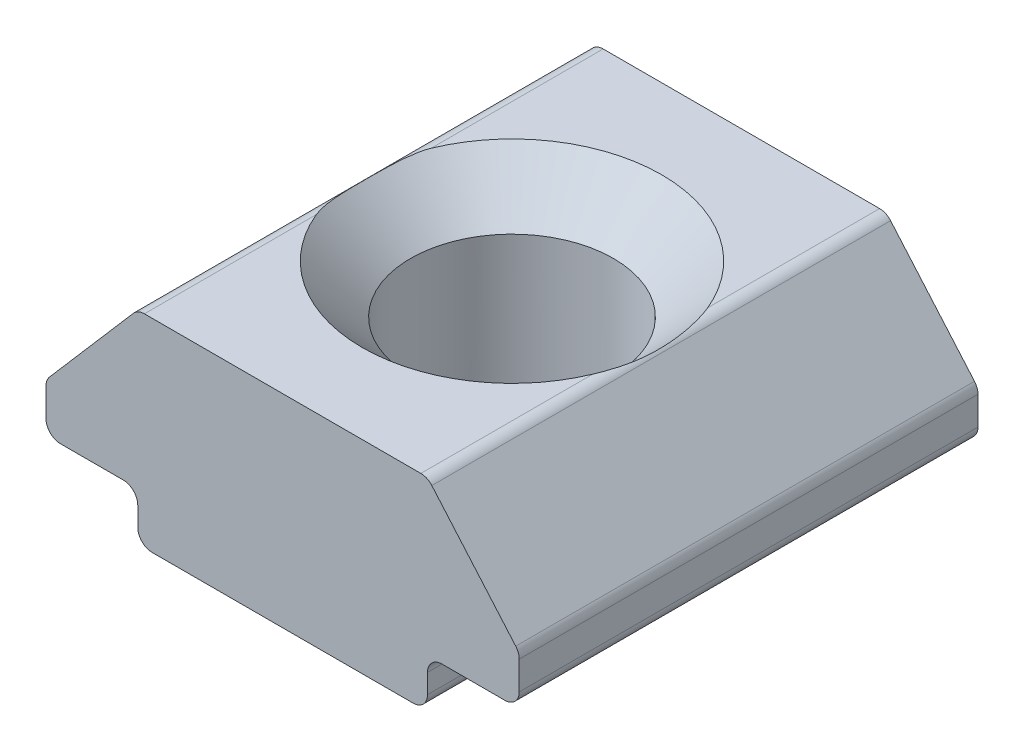
ISO-10303-21;
HEADER;
FILE_DESCRIPTION(('STEP AP214'),'2;1');
FILE_NAME('part.step','',(''),(''),'','','');
FILE_SCHEMA(('AUTOMOTIVE_DESIGN { 1 0 10303 214 1 1 1 1 }'));
ENDSEC;
DATA;
#1=APPLICATION_CONTEXT('core data for automotive mechanical design processes');
#2=APPLICATION_PROTOCOL_DEFINITION('international standard','automotive_design',2000,#1);
#3=PRODUCT_CONTEXT('',#1,'mechanical');
#4=PRODUCT('Part','Part','',(#3));
#5=PRODUCT_RELATED_PRODUCT_CATEGORY('part','',(#4));
#6=PRODUCT_DEFINITION_FORMATION('','',#4);
#7=PRODUCT_DEFINITION_CONTEXT('part definition',#1,'design');
#8=PRODUCT_DEFINITION('design','',#6,#7);
#9=PRODUCT_DEFINITION_SHAPE('','',#8);
#10=(LENGTH_UNIT() NAMED_UNIT(*) SI_UNIT(.MILLI.,.METRE.));
#11=(NAMED_UNIT(*) PLANE_ANGLE_UNIT() SI_UNIT($,.RADIAN.));
#12=(NAMED_UNIT(*) SI_UNIT($,.STERADIAN.) SOLID_ANGLE_UNIT());
#13=UNCERTAINTY_MEASURE_WITH_UNIT(LENGTH_MEASURE(1.E-05),#10,'distance_accuracy_value','');
#14=(GEOMETRIC_REPRESENTATION_CONTEXT(3) GLOBAL_UNCERTAINTY_ASSIGNED_CONTEXT((#13)) GLOBAL_UNIT_ASSIGNED_CONTEXT((#10,
#11,#12)) REPRESENTATION_CONTEXT('',''));
#15=CARTESIAN_POINT('',(0.,0.,0.));
#16=DIRECTION('',(0.,0.,1.));
#17=DIRECTION('',(1.,0.,0.));
#18=AXIS2_PLACEMENT_3D('',#15,#16,#17);
#19=CARTESIAN_POINT('',(1.95069575728712,4.37470932668439,3.52496458987025));
#20=DIRECTION('',(0.,-1.,0.));
#21=DIRECTION('',(0.,0.,-1.));
#22=AXIS2_PLACEMENT_3D('',#19,#20,#21);
#23=PLANE('',#22);
#24=DIRECTION('',(0.,0.,-1.));
#25=VECTOR('',#24,1.);
#26=CARTESIAN_POINT('',(1.81339279763943,4.37470932668439,3.52496458987025));
#27=LINE('',#26,#25);
#28=CARTESIAN_POINT('',(1.81339279763943,4.37470932668439,3.52496458987025));
#29=VERTEX_POINT('',#28);
#30=CARTESIAN_POINT('',(1.81339279763943,4.37470932668439,-0.0355121210941101));
#31=VERTEX_POINT('',#30);
#32=EDGE_CURVE('E234',#29,#31,#27,.T.);
#33=ORIENTED_EDGE('',*,*,#32,.T.);
#34=CARTESIAN_POINT('',(-1.04930424271288,4.37470932668439,-1.22503541012975));
#35=DIRECTION('',(0.,-1.,0.));
#36=DIRECTION('',(0.,0.,-1.));
#37=AXIS2_PLACEMENT_3D('',#34,#35,#36);
#38=CIRCLE('',#37,3.10000000000001);
#39=CARTESIAN_POINT('',(-3.91200128306519,4.37470932668439,-0.0355121210941145));
#40=VERTEX_POINT('',#39);
#41=EDGE_CURVE('E291',#31,#40,#38,.T.);
#42=ORIENTED_EDGE('',*,*,#41,.T.);
#43=DIRECTION('',(0.,0.,-1.));
#44=VECTOR('',#43,1.);
#45=CARTESIAN_POINT('',(-3.91200128306519,4.37470932668439,3.52496458987025));
#46=LINE('',#45,#44);
#47=CARTESIAN_POINT('',(-3.91200128306519,4.37470932668439,3.52496458987025));
#48=VERTEX_POINT('',#47);
#49=EDGE_CURVE('E236',#40,#48,#46,.F.);
#50=ORIENTED_EDGE('',*,*,#49,.T.);
#51=DIRECTION('',(-1.,0.,0.));
#52=VECTOR('',#51,1.);
#53=CARTESIAN_POINT('',(1.95069575728712,4.37470932668439,3.52496458987025));
#54=LINE('',#53,#52);
#55=EDGE_CURVE('E424',#29,#48,#54,.T.);
#56=ORIENTED_EDGE('',*,*,#55,.F.);
#57=EDGE_LOOP('',(#33,#42,#50,#56));
#58=FACE_BOUND('',#57,.T.);
#59=ADVANCED_FACE('F16',(#58),#23,.F.);
#60=CARTESIAN_POINT('',(-4.04930424271288,1.17470932668439,3.52496458987025));
#61=DIRECTION('',(1.,0.,0.));
#62=DIRECTION('',(0.,0.,-1.));
#63=AXIS2_PLACEMENT_3D('',#60,#61,#62);
#64=PLANE('',#63);
#65=DIRECTION('',(0.,-1.,0.));
#66=VECTOR('',#65,1.);
#67=CARTESIAN_POINT('',(-4.04930424271288,1.17470932668439,-5.97503541012975));
#68=LINE('',#67,#66);
#69=CARTESIAN_POINT('',(-4.04930424271288,0.874709326684388,-5.97503541012975));
#70=VERTEX_POINT('',#69);
#71=CARTESIAN_POINT('',(-4.04930424271288,0.474709326684388,-5.97503541012975));
#72=VERTEX_POINT('',#71);
#73=EDGE_CURVE('E428',#70,#72,#68,.T.);
#74=ORIENTED_EDGE('',*,*,#73,.T.);
#75=DIRECTION('',(0.,0.,-1.));
#76=VECTOR('',#75,1.);
#77=CARTESIAN_POINT('',(-4.04930424271288,0.474709326684388,3.52496458987025));
#78=LINE('',#77,#76);
#79=CARTESIAN_POINT('',(-4.04930424271288,0.474709326684388,3.52496458987025));
#80=VERTEX_POINT('',#79);
#81=EDGE_CURVE('E273',#72,#80,#78,.F.);
#82=ORIENTED_EDGE('',*,*,#81,.T.);
#83=DIRECTION('',(0.,-1.,0.));
#84=VECTOR('',#83,1.);
#85=CARTESIAN_POINT('',(-4.04930424271288,1.17470932668439,3.52496458987025));
#86=LINE('',#85,#84);
#87=CARTESIAN_POINT('',(-4.04930424271288,0.874709326684388,3.52496458987025));
#88=VERTEX_POINT('',#87);
#89=EDGE_CURVE('E194',#88,#80,#86,.T.);
#90=ORIENTED_EDGE('',*,*,#89,.F.);
#91=DIRECTION('',(0.,0.,-1.));
#92=VECTOR('',#91,1.);
#93=CARTESIAN_POINT('',(-4.04930424271288,0.874709326684388,-5.97503541012975));
#94=LINE('',#93,#92);
#95=EDGE_CURVE('E270',#88,#70,#94,.T.);
#96=ORIENTED_EDGE('',*,*,#95,.T.);
#97=EDGE_LOOP('',(#74,#82,#90,#96));
#98=FACE_BOUND('',#97,.T.);
#99=ADVANCED_FACE('F349',(#98),#64,.F.);
#100=CARTESIAN_POINT('',(-4.04930424271288,0.174709326684388,3.52496458987025));
#101=DIRECTION('',(0.,1.,0.));
#102=DIRECTION('',(0.,0.,1.));
#103=AXIS2_PLACEMENT_3D('',#100,#101,#102);
#104=PLANE('',#103);
#105=CARTESIAN_POINT('',(-1.04930424271288,0.174709326684388,-1.22503541012975));
#106=DIRECTION('',(0.,1.,0.));
#107=DIRECTION('',(0.,0.,1.));
#108=AXIS2_PLACEMENT_3D('',#105,#106,#107);
#109=CIRCLE('',#108,2.6);
#110=CARTESIAN_POINT('',(-1.04930424271288,0.174709326684388,1.37496458987025));
#111=VERTEX_POINT('',#110);
#112=EDGE_CURVE('E24',#111,#111,#109,.T.);
#113=ORIENTED_EDGE('',*,*,#112,.T.);
#114=EDGE_LOOP('',(#113));
#115=FACE_BOUND('',#114,.T.);
#116=DIRECTION('',(1.,0.,0.));
#117=VECTOR('',#116,1.);
#118=CARTESIAN_POINT('',(-4.04930424271288,0.174709326684388,-5.97503541012975));
#119=LINE('',#118,#117);
#120=CARTESIAN_POINT('',(-3.74930424271288,0.174709326684388,-5.97503541012975));
#121=VERTEX_POINT('',#120);
#122=CARTESIAN_POINT('',(1.65069575728712,0.174709326684388,-5.97503541012975));
#123=VERTEX_POINT('',#122);
#124=EDGE_CURVE('E431',#121,#123,#119,.T.);
#125=ORIENTED_EDGE('',*,*,#124,.T.);
#126=DIRECTION('',(0.,0.,-1.));
#127=VECTOR('',#126,1.);
#128=CARTESIAN_POINT('',(1.65069575728712,0.174709326684388,3.52496458987025));
#129=LINE('',#128,#127);
#130=CARTESIAN_POINT('',(1.65069575728712,0.174709326684388,3.52496458987025));
#131=VERTEX_POINT('',#130);
#132=EDGE_CURVE('E264',#123,#131,#129,.F.);
#133=ORIENTED_EDGE('',*,*,#132,.T.);
#134=DIRECTION('',(1.,0.,0.));
#135=VECTOR('',#134,1.);
#136=CARTESIAN_POINT('',(-4.04930424271288,0.174709326684388,3.52496458987025));
#137=LINE('',#136,#135);
#138=CARTESIAN_POINT('',(-3.74930424271288,0.174709326684388,3.52496458987025));
#139=VERTEX_POINT('',#138);
#140=EDGE_CURVE('E198',#139,#131,#137,.T.);
#141=ORIENTED_EDGE('',*,*,#140,.F.);
#142=DIRECTION('',(0.,0.,-1.));
#143=VECTOR('',#142,1.);
#144=CARTESIAN_POINT('',(-3.74930424271288,0.174709326684388,3.52496458987025));
#145=LINE('',#144,#143);
#146=EDGE_CURVE('E261',#139,#121,#145,.T.);
#147=ORIENTED_EDGE('',*,*,#146,.T.);
#148=EDGE_LOOP('',(#125,#133,#141,#147));
#149=FACE_BOUND('',#148,.T.);
#150=ADVANCED_FACE('F356',(#115,#149),#104,.F.);
#151=CARTESIAN_POINT('',(1.95069575728712,0.174709326684388,3.52496458987025));
#152=DIRECTION('',(-1.,0.,0.));
#153=DIRECTION('',(0.,0.,1.));
#154=AXIS2_PLACEMENT_3D('',#151,#152,#153);
#155=PLANE('',#154);
#156=DIRECTION('',(0.,1.,0.));
#157=VECTOR('',#156,1.);
#158=CARTESIAN_POINT('',(1.95069575728712,0.174709326684388,3.52496458987025));
#159=LINE('',#158,#157);
#160=CARTESIAN_POINT('',(1.95069575728712,0.474709326684388,3.52496458987025));
#161=VERTEX_POINT('',#160);
#162=CARTESIAN_POINT('',(1.95069575728712,0.874709326684388,3.52496458987025));
#163=VERTEX_POINT('',#162);
#164=EDGE_CURVE('E464',#161,#163,#159,.T.);
#165=ORIENTED_EDGE('',*,*,#164,.F.);
#166=DIRECTION('',(0.,0.,-1.));
#167=VECTOR('',#166,1.);
#168=CARTESIAN_POINT('',(1.95069575728712,0.474709326684388,3.52496458987025));
#169=LINE('',#168,#167);
#170=CARTESIAN_POINT('',(1.95069575728712,0.474709326684388,-5.97503541012975));
#171=VERTEX_POINT('',#170);
#172=EDGE_CURVE('E254',#161,#171,#169,.T.);
#173=ORIENTED_EDGE('',*,*,#172,.T.);
#174=DIRECTION('',(0.,1.,0.));
#175=VECTOR('',#174,1.);
#176=CARTESIAN_POINT('',(1.95069575728712,0.174709326684388,-5.97503541012975));
#177=LINE('',#176,#175);
#178=CARTESIAN_POINT('',(1.95069575728712,0.874709326684388,-5.97503541012975));
#179=VERTEX_POINT('',#178);
#180=EDGE_CURVE('E434',#171,#179,#177,.T.);
#181=ORIENTED_EDGE('',*,*,#180,.T.);
#182=DIRECTION('',(0.,0.,-1.));
#183=VECTOR('',#182,1.);
#184=CARTESIAN_POINT('',(1.95069575728712,0.874709326684388,3.52496458987025));
#185=LINE('',#184,#183);
#186=EDGE_CURVE('E252',#179,#163,#185,.F.);
#187=ORIENTED_EDGE('',*,*,#186,.T.);
#188=EDGE_LOOP('',(#165,#173,#181,#187));
#189=FACE_BOUND('',#188,.T.);
#190=ADVANCED_FACE('F475',(#189),#155,.F.);
#191=CARTESIAN_POINT('',(1.95069575728712,1.17470932668439,3.52496458987025));
#192=DIRECTION('',(0.,1.,0.));
#193=DIRECTION('',(0.,0.,1.));
#194=AXIS2_PLACEMENT_3D('',#191,#192,#193);
#195=PLANE('',#194);
#196=DIRECTION('',(1.,0.,0.));
#197=VECTOR('',#196,1.);
#198=CARTESIAN_POINT('',(1.95069575728712,1.17470932668439,3.52496458987025));
#199=LINE('',#198,#197);
#200=CARTESIAN_POINT('',(2.25069575728712,1.17470932668439,3.52496458987025));
#201=VERTEX_POINT('',#200);
#202=CARTESIAN_POINT('',(3.55069575728712,1.17470932668439,3.52496458987025));
#203=VERTEX_POINT('',#202);
#204=EDGE_CURVE('E462',#201,#203,#199,.T.);
#205=ORIENTED_EDGE('',*,*,#204,.F.);
#206=DIRECTION('',(0.,0.,-1.));
#207=VECTOR('',#206,1.);
#208=CARTESIAN_POINT('',(2.25069575728712,1.17470932668439,-5.97503541012975));
#209=LINE('',#208,#207);
#210=CARTESIAN_POINT('',(2.25069575728712,1.17470932668439,-5.97503541012975));
#211=VERTEX_POINT('',#210);
#212=EDGE_CURVE('E275',#201,#211,#209,.T.);
#213=ORIENTED_EDGE('',*,*,#212,.T.);
#214=DIRECTION('',(1.,0.,0.));
#215=VECTOR('',#214,1.);
#216=CARTESIAN_POINT('',(1.95069575728712,1.17470932668439,-5.97503541012975));
#217=LINE('',#216,#215);
#218=CARTESIAN_POINT('',(3.55069575728712,1.17470932668439,-5.97503541012975));
#219=VERTEX_POINT('',#218);
#220=EDGE_CURVE('E437',#211,#219,#217,.T.);
#221=ORIENTED_EDGE('',*,*,#220,.T.);
#222=DIRECTION('',(0.,0.,-1.));
#223=VECTOR('',#222,1.);
#224=CARTESIAN_POINT('',(3.55069575728712,1.17470932668439,3.52496458987025));
#225=LINE('',#224,#223);
#226=EDGE_CURVE('E249',#219,#203,#225,.F.);
#227=ORIENTED_EDGE('',*,*,#226,.T.);
#228=EDGE_LOOP('',(#205,#213,#221,#227));
#229=FACE_BOUND('',#228,.T.);
#230=ADVANCED_FACE('F483',(#229),#195,.F.);
#231=CARTESIAN_POINT('',(3.85069575728712,1.17470932668439,3.52496458987025));
#232=DIRECTION('',(-1.,0.,0.));
#233=DIRECTION('',(0.,0.,1.));
#234=AXIS2_PLACEMENT_3D('',#231,#232,#233);
#235=PLANE('',#234);
#236=DIRECTION('',(0.,1.,0.));
#237=VECTOR('',#236,1.);
#238=CARTESIAN_POINT('',(3.85069575728712,1.17470932668439,-5.97503541012975));
#239=LINE('',#238,#237);
#240=CARTESIAN_POINT('',(3.85069575728712,1.47470932668439,-5.97503541012975));
#241=VERTEX_POINT('',#240);
#242=CARTESIAN_POINT('',(3.85069575728712,2.06309537340811,-5.97503541012975));
#243=VERTEX_POINT('',#242);
#244=EDGE_CURVE('E439',#241,#243,#239,.T.);
#245=ORIENTED_EDGE('',*,*,#244,.T.);
#246=DIRECTION('',(0.,0.,-1.));
#247=VECTOR('',#246,1.);
#248=CARTESIAN_POINT('',(3.85069575728712,2.06309537340811,3.52496458987025));
#249=LINE('',#248,#247);
#250=CARTESIAN_POINT('',(3.85069575728712,2.06309537340811,3.52496458987025));
#251=VERTEX_POINT('',#250);
#252=EDGE_CURVE('E247',#243,#251,#249,.F.);
#253=ORIENTED_EDGE('',*,*,#252,.T.);
#254=DIRECTION('',(0.,1.,0.));
#255=VECTOR('',#254,1.);
#256=CARTESIAN_POINT('',(3.85069575728712,1.17470932668439,3.52496458987025));
#257=LINE('',#256,#255);
#258=CARTESIAN_POINT('',(3.85069575728712,1.47470932668439,3.52496458987025));
#259=VERTEX_POINT('',#258);
#260=EDGE_CURVE('E457',#259,#251,#257,.T.);
#261=ORIENTED_EDGE('',*,*,#260,.F.);
#262=DIRECTION('',(0.,0.,-1.));
#263=VECTOR('',#262,1.);
#264=CARTESIAN_POINT('',(3.85069575728712,1.47470932668439,3.52496458987025));
#265=LINE('',#264,#263);
#266=EDGE_CURVE('E244',#259,#241,#265,.T.);
#267=ORIENTED_EDGE('',*,*,#266,.T.);
#268=EDGE_LOOP('',(#245,#253,#261,#267));
#269=FACE_BOUND('',#268,.T.);
#270=ADVANCED_FACE('F370',(#269),#235,.F.);
#271=CARTESIAN_POINT('',(3.85069575728712,2.17470932668439,3.52496458987025));
#272=DIRECTION('',(-0.756823007769159,-0.653619870346093,0.));
#273=DIRECTION('',(0.653619870346093,-0.756823007769159,0.));
#274=AXIS2_PLACEMENT_3D('',#271,#272,#273);
#275=PLANE('',#274);
#276=DIRECTION('',(-0.653619870346093,0.756823007769159,0.));
#277=VECTOR('',#276,1.);
#278=CARTESIAN_POINT('',(3.85069575728712,2.17470932668439,-5.97503541012975));
#279=LINE('',#278,#277);
#280=CARTESIAN_POINT('',(3.77774265961787,2.25918133451194,-5.97503541012975));
#281=VERTEX_POINT('',#280);
#282=CARTESIAN_POINT('',(2.04043969997018,4.27079528778822,-5.97503541012975));
#283=VERTEX_POINT('',#282);
#284=EDGE_CURVE('E442',#281,#283,#279,.T.);
#285=ORIENTED_EDGE('',*,*,#284,.T.);
#286=DIRECTION('',(0.,0.,-1.));
#287=VECTOR('',#286,1.);
#288=CARTESIAN_POINT('',(2.04043969997018,4.27079528778822,3.52496458987025));
#289=LINE('',#288,#287);
#290=CARTESIAN_POINT('',(2.04043969997018,4.27079528778822,3.52496458987025));
#291=VERTEX_POINT('',#290);
#292=EDGE_CURVE('E242',#283,#291,#289,.F.);
#293=ORIENTED_EDGE('',*,*,#292,.T.);
#294=DIRECTION('',(-0.653619870346093,0.756823007769159,0.));
#295=VECTOR('',#294,1.);
#296=CARTESIAN_POINT('',(3.85069575728712,2.17470932668439,3.52496458987025));
#297=LINE('',#296,#295);
#298=CARTESIAN_POINT('',(3.77774265961787,2.25918133451194,3.52496458987025));
#299=VERTEX_POINT('',#298);
#300=EDGE_CURVE('E455',#299,#291,#297,.T.);
#301=ORIENTED_EDGE('',*,*,#300,.F.);
#302=DIRECTION('',(0.,0.,-1.));
#303=VECTOR('',#302,1.);
#304=CARTESIAN_POINT('',(3.77774265961787,2.25918133451194,3.52496458987025));
#305=LINE('',#304,#303);
#306=EDGE_CURVE('E239',#299,#281,#305,.T.);
#307=ORIENTED_EDGE('',*,*,#306,.T.);
#308=EDGE_LOOP('',(#285,#293,#301,#307));
#309=FACE_BOUND('',#308,.T.);
#310=ADVANCED_FACE('F363',(#309),#275,.F.);
#311=CARTESIAN_POINT('',(-3.91200128306519,4.37470932668439,-5.97503541012975));
#312=VERTEX_POINT('',#311);
#313=CARTESIAN_POINT('',(-3.91200128306519,4.37470932668439,-2.41455869916539));
#314=VERTEX_POINT('',#313);
#315=EDGE_CURVE('E237',#312,#314,#46,.F.);
#316=ORIENTED_EDGE('',*,*,#315,.T.);
#317=CARTESIAN_POINT('',(-1.04930424271288,4.37470932668439,-1.22503541012975));
#318=DIRECTION('',(0.,-1.,0.));
#319=DIRECTION('',(0.,0.,-1.));
#320=AXIS2_PLACEMENT_3D('',#317,#318,#319);
#321=CIRCLE('',#320,3.10000000000001);
#322=CARTESIAN_POINT('',(1.81339279763943,4.37470932668439,-2.41455869916539));
#323=VERTEX_POINT('',#322);
#324=EDGE_CURVE('E31',#314,#323,#321,.T.);
#325=ORIENTED_EDGE('',*,*,#324,.T.);
#326=CARTESIAN_POINT('',(1.81339279763943,4.37470932668439,-5.97503541012975));
#327=VERTEX_POINT('',#326);
#328=EDGE_CURVE('E233',#323,#327,#27,.T.);
#329=ORIENTED_EDGE('',*,*,#328,.T.);
#330=DIRECTION('',(-1.,0.,0.));
#331=VECTOR('',#330,1.);
#332=CARTESIAN_POINT('',(1.95069575728712,4.37470932668439,-5.97503541012975));
#333=LINE('',#332,#331);
#334=EDGE_CURVE('E375',#327,#312,#333,.T.);
#335=ORIENTED_EDGE('',*,*,#334,.T.);
#336=EDGE_LOOP('',(#316,#325,#329,#335));
#337=FACE_BOUND('',#336,.T.);
#338=ADVANCED_FACE('F352',(#337),#23,.F.);
#339=CARTESIAN_POINT('',(-5.94930424271288,2.17470932668439,3.52496458987025));
#340=DIRECTION('',(0.756823007769159,-0.653619870346093,0.));
#341=DIRECTION('',(0.653619870346093,0.756823007769159,0.));
#342=AXIS2_PLACEMENT_3D('',#339,#340,#341);
#343=PLANE('',#342);
#344=DIRECTION('',(-0.653619870346093,-0.756823007769159,0.));
#345=VECTOR('',#344,1.);
#346=CARTESIAN_POINT('',(-5.94930424271288,2.17470932668439,-5.97503541012975));
#347=LINE('',#346,#345);
#348=CARTESIAN_POINT('',(-4.13904818539594,4.27079528778822,-5.97503541012975));
#349=VERTEX_POINT('',#348);
#350=CARTESIAN_POINT('',(-5.87635114504363,2.25918133451194,-5.97503541012975));
#351=VERTEX_POINT('',#350);
#352=EDGE_CURVE('E200',#349,#351,#347,.T.);
#353=ORIENTED_EDGE('',*,*,#352,.T.);
#354=DIRECTION('',(0.,0.,-1.));
#355=VECTOR('',#354,1.);
#356=CARTESIAN_POINT('',(-5.87635114504363,2.25918133451194,3.52496458987025));
#357=LINE('',#356,#355);
#358=CARTESIAN_POINT('',(-5.87635114504363,2.25918133451194,3.52496458987025));
#359=VERTEX_POINT('',#358);
#360=EDGE_CURVE('E231',#351,#359,#357,.F.);
#361=ORIENTED_EDGE('',*,*,#360,.T.);
#362=DIRECTION('',(-0.653619870346093,-0.756823007769159,0.));
#363=VECTOR('',#362,1.);
#364=CARTESIAN_POINT('',(-5.94930424271288,2.17470932668439,3.52496458987025));
#365=LINE('',#364,#363);
#366=CARTESIAN_POINT('',(-4.13904818539594,4.27079528778822,3.52496458987025));
#367=VERTEX_POINT('',#366);
#368=EDGE_CURVE('E421',#367,#359,#365,.T.);
#369=ORIENTED_EDGE('',*,*,#368,.F.);
#370=DIRECTION('',(0.,0.,-1.));
#371=VECTOR('',#370,1.);
#372=CARTESIAN_POINT('',(-4.13904818539594,4.27079528778822,3.52496458987025));
#373=LINE('',#372,#371);
#374=EDGE_CURVE('E228',#367,#349,#373,.T.);
#375=ORIENTED_EDGE('',*,*,#374,.T.);
#376=EDGE_LOOP('',(#353,#361,#369,#375));
#377=FACE_BOUND('',#376,.T.);
#378=ADVANCED_FACE('F362',(#377),#343,.F.);
#379=CARTESIAN_POINT('',(-5.94930424271288,1.17470932668439,3.52496458987025));
#380=DIRECTION('',(1.,0.,0.));
#381=DIRECTION('',(0.,0.,-1.));
#382=AXIS2_PLACEMENT_3D('',#379,#380,#381);
#383=PLANE('',#382);
#384=DIRECTION('',(0.,-1.,0.));
#385=VECTOR('',#384,1.);
#386=CARTESIAN_POINT('',(-5.94930424271288,1.17470932668439,-5.97503541012975));
#387=LINE('',#386,#385);
#388=CARTESIAN_POINT('',(-5.94930424271288,2.06309537340811,-5.97503541012975));
#389=VERTEX_POINT('',#388);
#390=CARTESIAN_POINT('',(-5.94930424271288,1.47470932668439,-5.97503541012975));
#391=VERTEX_POINT('',#390);
#392=EDGE_CURVE('E195',#389,#391,#387,.T.);
#393=ORIENTED_EDGE('',*,*,#392,.T.);
#394=DIRECTION('',(0.,0.,-1.));
#395=VECTOR('',#394,1.);
#396=CARTESIAN_POINT('',(-5.94930424271288,1.47470932668439,3.52496458987025));
#397=LINE('',#396,#395);
#398=CARTESIAN_POINT('',(-5.94930424271288,1.47470932668439,3.52496458987025));
#399=VERTEX_POINT('',#398);
#400=EDGE_CURVE('E172',#391,#399,#397,.F.);
#401=ORIENTED_EDGE('',*,*,#400,.T.);
#402=DIRECTION('',(0.,-1.,0.));
#403=VECTOR('',#402,1.);
#404=CARTESIAN_POINT('',(-5.94930424271288,1.17470932668439,3.52496458987025));
#405=LINE('',#404,#403);
#406=CARTESIAN_POINT('',(-5.94930424271288,2.06309537340811,3.52496458987025));
#407=VERTEX_POINT('',#406);
#408=EDGE_CURVE('E420',#407,#399,#405,.T.);
#409=ORIENTED_EDGE('',*,*,#408,.F.);
#410=DIRECTION('',(0.,0.,-1.));
#411=VECTOR('',#410,1.);
#412=CARTESIAN_POINT('',(-5.94930424271288,2.06309537340811,3.52496458987025));
#413=LINE('',#412,#411);
#414=EDGE_CURVE('E177',#407,#389,#413,.T.);
#415=ORIENTED_EDGE('',*,*,#414,.T.);
#416=EDGE_LOOP('',(#393,#401,#409,#415));
#417=FACE_BOUND('',#416,.T.);
#418=ADVANCED_FACE('F368',(#417),#383,.F.);
#419=CARTESIAN_POINT('',(-5.94930424271288,1.17470932668439,3.52496458987025));
#420=DIRECTION('',(0.,1.,0.));
#421=DIRECTION('',(0.,0.,1.));
#422=AXIS2_PLACEMENT_3D('',#419,#420,#421);
#423=PLANE('',#422);
#424=DIRECTION('',(1.,0.,0.));
#425=VECTOR('',#424,1.);
#426=CARTESIAN_POINT('',(-5.94930424271288,1.17470932668439,-5.97503541012975));
#427=LINE('',#426,#425);
#428=CARTESIAN_POINT('',(-5.64930424271288,1.17470932668439,-5.97503541012975));
#429=VERTEX_POINT('',#428);
#430=CARTESIAN_POINT('',(-4.34930424271288,1.17470932668439,-5.97503541012975));
#431=VERTEX_POINT('',#430);
#432=EDGE_CURVE('E184',#429,#431,#427,.T.);
#433=ORIENTED_EDGE('',*,*,#432,.T.);
#434=DIRECTION('',(0.,0.,-1.));
#435=VECTOR('',#434,1.);
#436=CARTESIAN_POINT('',(-4.34930424271288,1.17470932668439,3.52496458987025));
#437=LINE('',#436,#435);
#438=CARTESIAN_POINT('',(-4.34930424271288,1.17470932668439,3.52496458987025));
#439=VERTEX_POINT('',#438);
#440=EDGE_CURVE('E278',#431,#439,#437,.F.);
#441=ORIENTED_EDGE('',*,*,#440,.T.);
#442=DIRECTION('',(1.,0.,0.));
#443=VECTOR('',#442,1.);
#444=CARTESIAN_POINT('',(-5.94930424271288,1.17470932668439,3.52496458987025));
#445=LINE('',#444,#443);
#446=CARTESIAN_POINT('',(-5.64930424271288,1.17470932668439,3.52496458987025));
#447=VERTEX_POINT('',#446);
#448=EDGE_CURVE('E187',#447,#439,#445,.T.);
#449=ORIENTED_EDGE('',*,*,#448,.F.);
#450=DIRECTION('',(0.,0.,-1.));
#451=VECTOR('',#450,1.);
#452=CARTESIAN_POINT('',(-5.64930424271288,1.17470932668439,3.52496458987025));
#453=LINE('',#452,#451);
#454=EDGE_CURVE('E171',#447,#429,#453,.T.);
#455=ORIENTED_EDGE('',*,*,#454,.T.);
#456=EDGE_LOOP('',(#433,#441,#449,#455));
#457=FACE_BOUND('',#456,.T.);
#458=ADVANCED_FACE('F183',(#457),#423,.F.);
#459=CARTESIAN_POINT('',(-1.04930424271288,0.174709326684388,3.52496458987025));
#460=DIRECTION('',(0.,0.,1.));
#461=DIRECTION('',(1.,0.,0.));
#462=AXIS2_PLACEMENT_3D('',#459,#460,#461);
#463=PLANE('',#462);
#464=ORIENTED_EDGE('',*,*,#140,.T.);
#465=CARTESIAN_POINT('',(1.65069575728712,0.474709326684388,3.52496458987025));
#466=DIRECTION('',(0.,0.,1.));
#467=DIRECTION('',(1.,0.,0.));
#468=AXIS2_PLACEMENT_3D('',#465,#466,#467);
#469=CIRCLE('',#468,0.3);
#470=EDGE_CURVE('E268',#131,#161,#469,.T.);
#471=ORIENTED_EDGE('',*,*,#470,.T.);
#472=ORIENTED_EDGE('',*,*,#164,.T.);
#473=CARTESIAN_POINT('',(2.25069575728712,0.874709326684388,3.52496458987025));
#474=DIRECTION('',(0.,0.,1.));
#475=DIRECTION('',(1.,0.,0.));
#476=AXIS2_PLACEMENT_3D('',#473,#474,#475);
#477=CIRCLE('',#476,0.3);
#478=EDGE_CURVE('E282',#163,#201,#477,.F.);
#479=ORIENTED_EDGE('',*,*,#478,.T.);
#480=ORIENTED_EDGE('',*,*,#204,.T.);
#481=CARTESIAN_POINT('',(3.55069575728712,1.47470932668439,3.52496458987025));
#482=DIRECTION('',(0.,0.,1.));
#483=DIRECTION('',(1.,0.,0.));
#484=AXIS2_PLACEMENT_3D('',#481,#482,#483);
#485=CIRCLE('',#484,0.3);
#486=EDGE_CURVE('E216',#203,#259,#485,.T.);
#487=ORIENTED_EDGE('',*,*,#486,.T.);
#488=ORIENTED_EDGE('',*,*,#260,.T.);
#489=CARTESIAN_POINT('',(3.55069575728712,2.06309537340811,3.52496458987025));
#490=DIRECTION('',(0.,0.,1.));
#491=DIRECTION('',(1.,0.,0.));
#492=AXIS2_PLACEMENT_3D('',#489,#490,#491);
#493=CIRCLE('',#492,0.3);
#494=EDGE_CURVE('E218',#251,#299,#493,.T.);
#495=ORIENTED_EDGE('',*,*,#494,.T.);
#496=ORIENTED_EDGE('',*,*,#300,.T.);
#497=CARTESIAN_POINT('',(1.81339279763943,4.07470932668439,3.52496458987025));
#498=DIRECTION('',(0.,0.,1.));
#499=DIRECTION('',(1.,0.,0.));
#500=AXIS2_PLACEMENT_3D('',#497,#498,#499);
#501=CIRCLE('',#500,0.3);
#502=EDGE_CURVE('E220',#291,#29,#501,.T.);
#503=ORIENTED_EDGE('',*,*,#502,.T.);
#504=ORIENTED_EDGE('',*,*,#55,.T.);
#505=CARTESIAN_POINT('',(-3.91200128306519,4.07470932668439,3.52496458987025));
#506=DIRECTION('',(0.,0.,1.));
#507=DIRECTION('',(1.,0.,0.));
#508=AXIS2_PLACEMENT_3D('',#505,#506,#507);
#509=CIRCLE('',#508,0.3);
#510=EDGE_CURVE('E222',#48,#367,#509,.T.);
#511=ORIENTED_EDGE('',*,*,#510,.T.);
#512=ORIENTED_EDGE('',*,*,#368,.T.);
#513=CARTESIAN_POINT('',(-5.64930424271288,2.06309537340811,3.52496458987025));
#514=DIRECTION('',(0.,0.,1.));
#515=DIRECTION('',(1.,0.,0.));
#516=AXIS2_PLACEMENT_3D('',#513,#514,#515);
#517=CIRCLE('',#516,0.3);
#518=EDGE_CURVE('E224',#359,#407,#517,.T.);
#519=ORIENTED_EDGE('',*,*,#518,.T.);
#520=ORIENTED_EDGE('',*,*,#408,.T.);
#521=CARTESIAN_POINT('',(-5.64930424271288,1.47470932668439,3.52496458987025));
#522=DIRECTION('',(0.,0.,1.));
#523=DIRECTION('',(1.,0.,0.));
#524=AXIS2_PLACEMENT_3D('',#521,#522,#523);
#525=CIRCLE('',#524,0.3);
#526=EDGE_CURVE('E226',#399,#447,#525,.T.);
#527=ORIENTED_EDGE('',*,*,#526,.T.);
#528=ORIENTED_EDGE('',*,*,#448,.T.);
#529=CARTESIAN_POINT('',(-4.34930424271288,0.874709326684388,3.52496458987025));
#530=DIRECTION('',(0.,0.,1.));
#531=DIRECTION('',(1.,0.,0.));
#532=AXIS2_PLACEMENT_3D('',#529,#530,#531);
#533=CIRCLE('',#532,0.3);
#534=EDGE_CURVE('E285',#439,#88,#533,.F.);
#535=ORIENTED_EDGE('',*,*,#534,.T.);
#536=ORIENTED_EDGE('',*,*,#89,.T.);
#537=CARTESIAN_POINT('',(-3.74930424271288,0.474709326684388,3.52496458987025));
#538=DIRECTION('',(0.,0.,1.));
#539=DIRECTION('',(1.,0.,0.));
#540=AXIS2_PLACEMENT_3D('',#537,#538,#539);
#541=CIRCLE('',#540,0.3);
#542=EDGE_CURVE('E266',#80,#139,#541,.T.);
#543=ORIENTED_EDGE('',*,*,#542,.T.);
#544=EDGE_LOOP('',(#464,#471,#472,#479,#480,#487,#488,#495,#496,#503,#504,#511,#512,#519,#520,
#527,#528,#535,#536,#543));
#545=FACE_BOUND('',#544,.T.);
#546=ADVANCED_FACE('F396',(#545),#463,.T.);
#547=CARTESIAN_POINT('',(-1.04930424271288,0.174709326684388,-5.97503541012975));
#548=DIRECTION('',(0.,0.,1.));
#549=DIRECTION('',(1.,0.,0.));
#550=AXIS2_PLACEMENT_3D('',#547,#548,#549);
#551=PLANE('',#550);
#552=ORIENTED_EDGE('',*,*,#180,.F.);
#553=CARTESIAN_POINT('',(1.65069575728712,0.474709326684388,-5.97503541012975));
#554=DIRECTION('',(0.,0.,1.));
#555=DIRECTION('',(1.,0.,0.));
#556=AXIS2_PLACEMENT_3D('',#553,#554,#555);
#557=CIRCLE('',#556,0.3);
#558=EDGE_CURVE('E259',#171,#123,#557,.F.);
#559=ORIENTED_EDGE('',*,*,#558,.T.);
#560=ORIENTED_EDGE('',*,*,#124,.F.);
#561=CARTESIAN_POINT('',(-3.74930424271288,0.474709326684388,-5.97503541012975));
#562=DIRECTION('',(0.,0.,1.));
#563=DIRECTION('',(1.,0.,0.));
#564=AXIS2_PLACEMENT_3D('',#561,#562,#563);
#565=CIRCLE('',#564,0.3);
#566=EDGE_CURVE('E257',#121,#72,#565,.F.);
#567=ORIENTED_EDGE('',*,*,#566,.T.);
#568=ORIENTED_EDGE('',*,*,#73,.F.);
#569=CARTESIAN_POINT('',(-4.34930424271288,0.874709326684388,-5.97503541012975));
#570=DIRECTION('',(0.,0.,1.));
#571=DIRECTION('',(1.,0.,0.));
#572=AXIS2_PLACEMENT_3D('',#569,#570,#571);
#573=CIRCLE('',#572,0.3);
#574=EDGE_CURVE('E193',#70,#431,#573,.T.);
#575=ORIENTED_EDGE('',*,*,#574,.T.);
#576=ORIENTED_EDGE('',*,*,#432,.F.);
#577=CARTESIAN_POINT('',(-5.64930424271288,1.47470932668439,-5.97503541012975));
#578=DIRECTION('',(0.,0.,1.));
#579=DIRECTION('',(1.,0.,0.));
#580=AXIS2_PLACEMENT_3D('',#577,#578,#579);
#581=CIRCLE('',#580,0.3);
#582=EDGE_CURVE('E167',#429,#391,#581,.F.);
#583=ORIENTED_EDGE('',*,*,#582,.T.);
#584=ORIENTED_EDGE('',*,*,#392,.F.);
#585=CARTESIAN_POINT('',(-5.64930424271288,2.06309537340811,-5.97503541012975));
#586=DIRECTION('',(0.,0.,1.));
#587=DIRECTION('',(1.,0.,0.));
#588=AXIS2_PLACEMENT_3D('',#585,#586,#587);
#589=CIRCLE('',#588,0.3);
#590=EDGE_CURVE('E178',#389,#351,#589,.F.);
#591=ORIENTED_EDGE('',*,*,#590,.T.);
#592=ORIENTED_EDGE('',*,*,#352,.F.);
#593=CARTESIAN_POINT('',(-3.91200128306519,4.07470932668439,-5.97503541012975));
#594=DIRECTION('',(0.,0.,1.));
#595=DIRECTION('',(1.,0.,0.));
#596=AXIS2_PLACEMENT_3D('',#593,#594,#595);
#597=CIRCLE('',#596,0.3);
#598=EDGE_CURVE('E210',#349,#312,#597,.F.);
#599=ORIENTED_EDGE('',*,*,#598,.T.);
#600=ORIENTED_EDGE('',*,*,#334,.F.);
#601=CARTESIAN_POINT('',(1.81339279763943,4.07470932668439,-5.97503541012975));
#602=DIRECTION('',(0.,0.,1.));
#603=DIRECTION('',(1.,0.,0.));
#604=AXIS2_PLACEMENT_3D('',#601,#602,#603);
#605=CIRCLE('',#604,0.3);
#606=EDGE_CURVE('E208',#327,#283,#605,.F.);
#607=ORIENTED_EDGE('',*,*,#606,.T.);
#608=ORIENTED_EDGE('',*,*,#284,.F.);
#609=CARTESIAN_POINT('',(3.55069575728712,2.06309537340811,-5.97503541012975));
#610=DIRECTION('',(0.,0.,1.));
#611=DIRECTION('',(1.,0.,0.));
#612=AXIS2_PLACEMENT_3D('',#609,#610,#611);
#613=CIRCLE('',#612,0.3);
#614=EDGE_CURVE('E206',#281,#243,#613,.F.);
#615=ORIENTED_EDGE('',*,*,#614,.T.);
#616=ORIENTED_EDGE('',*,*,#244,.F.);
#617=CARTESIAN_POINT('',(3.55069575728712,1.47470932668439,-5.97503541012975));
#618=DIRECTION('',(0.,0.,1.));
#619=DIRECTION('',(1.,0.,0.));
#620=AXIS2_PLACEMENT_3D('',#617,#618,#619);
#621=CIRCLE('',#620,0.3);
#622=EDGE_CURVE('E188',#241,#219,#621,.F.);
#623=ORIENTED_EDGE('',*,*,#622,.T.);
#624=ORIENTED_EDGE('',*,*,#220,.F.);
#625=CARTESIAN_POINT('',(2.25069575728712,0.874709326684388,-5.97503541012975));
#626=DIRECTION('',(0.,0.,1.));
#627=DIRECTION('',(1.,0.,0.));
#628=AXIS2_PLACEMENT_3D('',#625,#626,#627);
#629=CIRCLE('',#628,0.3);
#630=EDGE_CURVE('E280',#211,#179,#629,.T.);
#631=ORIENTED_EDGE('',*,*,#630,.T.);
#632=EDGE_LOOP('',(#552,#559,#560,#567,#568,#575,#576,#583,#584,#591,#592,#599,#600,#607,#608,
#615,#616,#623,#624,#631));
#633=FACE_BOUND('',#632,.T.);
#634=ADVANCED_FACE('F191',(#633),#551,.F.);
#635=CARTESIAN_POINT('',(-5.64930424271288,1.47470932668439,3.52496458987025));
#636=DIRECTION('',(0.,0.,-1.));
#637=DIRECTION('',(-1.,0.,0.));
#638=AXIS2_PLACEMENT_3D('',#635,#636,#637);
#639=CYLINDRICAL_SURFACE('',#638,0.3);
#640=ORIENTED_EDGE('',*,*,#526,.F.);
#641=ORIENTED_EDGE('',*,*,#400,.F.);
#642=ORIENTED_EDGE('',*,*,#582,.F.);
#643=ORIENTED_EDGE('',*,*,#454,.F.);
#644=EDGE_LOOP('',(#640,#641,#642,#643));
#645=FACE_BOUND('',#644,.T.);
#646=ADVANCED_FACE('F170',(#645),#639,.T.);
#647=CARTESIAN_POINT('',(-5.64930424271288,2.06309537340811,3.52496458987025));
#648=DIRECTION('',(0.,0.,-1.));
#649=DIRECTION('',(-1.,0.,0.));
#650=AXIS2_PLACEMENT_3D('',#647,#648,#649);
#651=CYLINDRICAL_SURFACE('',#650,0.3);
#652=ORIENTED_EDGE('',*,*,#518,.F.);
#653=ORIENTED_EDGE('',*,*,#360,.F.);
#654=ORIENTED_EDGE('',*,*,#590,.F.);
#655=ORIENTED_EDGE('',*,*,#414,.F.);
#656=EDGE_LOOP('',(#652,#653,#654,#655));
#657=FACE_BOUND('',#656,.T.);
#658=ADVANCED_FACE('F346',(#657),#651,.T.);
#659=CARTESIAN_POINT('',(-3.91200128306519,4.07470932668439,3.52496458987025));
#660=DIRECTION('',(0.,0.,-1.));
#661=DIRECTION('',(-1.,0.,0.));
#662=AXIS2_PLACEMENT_3D('',#659,#660,#661);
#663=CYLINDRICAL_SURFACE('',#662,0.3);
#664=ORIENTED_EDGE('',*,*,#49,.F.);
#665=CARTESIAN_POINT('',(-3.91200128306519,4.37470932668439,-0.0355121210941145));
#666=CARTESIAN_POINT('',(-3.92093273809777,4.374693554572,-0.0570470098650926));
#667=CARTESIAN_POINT('',(-3.9292758887637,4.37431076890047,-0.0788089705163304));
#668=CARTESIAN_POINT('',(-3.94494482720037,4.37300263556177,-0.122661683139957));
#669=CARTESIAN_POINT('',(-3.95227146699118,4.37207774571544,-0.144752142362414));
#670=CARTESIAN_POINT('',(-3.96606257664397,4.36987915694666,-0.189113489681193));
#671=CARTESIAN_POINT('',(-3.97252931070409,4.36860640214351,-0.211383733310665));
#672=CARTESIAN_POINT('',(-3.98473170266188,4.36582694088956,-0.256113691522338));
#673=CARTESIAN_POINT('',(-3.99046718080865,4.36432017711785,-0.278573451248721));
#674=CARTESIAN_POINT('',(-4.00674249906433,4.35958293741409,-0.346311434359917));
#675=CARTESIAN_POINT('',(-4.01630937565047,4.35614362496227,-0.391809495301165));
#676=CARTESIAN_POINT('',(-4.03334820461454,4.34922449801373,-0.483228453602967));
#677=CARTESIAN_POINT('',(-4.04081808712094,4.34574464700585,-0.529149722855095));
#678=CARTESIAN_POINT('',(-4.05562337016144,4.33825858887728,-0.632797498845656));
#679=CARTESIAN_POINT('',(-4.06245712813846,4.33433864557491,-0.690601905347718));
#680=CARTESIAN_POINT('',(-4.07376990477512,4.32744304562369,-0.806502923201305));
#681=CARTESIAN_POINT('',(-4.07824848847788,4.32446756343944,-0.864599586528531));
#682=CARTESIAN_POINT('',(-4.0851158700759,4.31975769240951,-0.980984905433432));
#683=CARTESIAN_POINT('',(-4.0875039960657,4.31802370263127,-1.03927361670031));
#684=CARTESIAN_POINT('',(-4.0903296289336,4.31596030421464,-1.15593009477394));
#685=CARTESIAN_POINT('',(-4.09076689284649,4.31563107052828,-1.21429787052214));
#686=CARTESIAN_POINT('',(-4.08971639369962,4.3164069939529,-1.33094546439005));
#687=CARTESIAN_POINT('',(-4.08823064551999,4.31751064972474,-1.38922531062067));
#688=CARTESIAN_POINT('',(-4.08325048449367,4.32104872743194,-1.50565175591438));
#689=CARTESIAN_POINT('',(-4.07975633168271,4.32348297708829,-1.56379837124907));
#690=CARTESIAN_POINT('',(-4.07055463280784,4.32944618181069,-1.67983252635171));
#691=CARTESIAN_POINT('',(-4.06484815008705,4.33297461080319,-1.73772017708898));
#692=CARTESIAN_POINT('',(-4.05088053160822,4.34074917695568,-1.85313016742764));
#693=CARTESIAN_POINT('',(-4.04262006516945,4.34499512594408,-1.91065259871562));
#694=CARTESIAN_POINT('',(-4.02628659939446,4.35217842601219,-2.00598104645263));
#695=CARTESIAN_POINT('',(-4.01907750781913,4.35507774815558,-2.04393773909221));
#696=CARTESIAN_POINT('',(-4.00305707741205,4.36068329507431,-2.11949731991768));
#697=CARTESIAN_POINT('',(-3.99424704664928,4.36338967500046,-2.15710047078089));
#698=CARTESIAN_POINT('',(-3.97470731921197,4.36825657421935,-2.23177856547513));
#699=CARTESIAN_POINT('',(-3.96398130927698,4.37041812295299,-2.26885437864499));
#700=CARTESIAN_POINT('',(-3.94604749557895,4.37283211552132,-2.32395158676038));
#701=CARTESIAN_POINT('',(-3.93975413313065,4.37349900115924,-2.34225112226904));
#702=CARTESIAN_POINT('',(-3.92644525849639,4.37443400184856,-2.37860706843417));
#703=CARTESIAN_POINT('',(-3.91942931881385,4.37470187936993,-2.396663327936));
#704=CARTESIAN_POINT('',(-3.91200128306519,4.37470932668439,-2.41455869916539));
#705=B_SPLINE_CURVE_WITH_KNOTS('',3,(#665,#666,#667,#668,#669,#670,#671,#672,#673,#674,#675,
#676,#677,#678,#679,#680,#681,#682,#683,#684,#685,#686,#687,#688,#689,#690,#691,#692,#693,#694,
#695,#696,#697,#698,#699,#700,#701,#702,#703,#704),.UNSPECIFIED.,.F.,.F.,(4,2,2,2,2,2,2,2,2,2,2,
2,2,2,2,2,2,2,2,4),(0.,0.069907177043742,0.139755400583714,0.209415904114081,0.279093498099061,
0.418883727227811,0.558811457227104,0.733762841880848,0.908746525463934,1.08378643088063,
1.25884813559337,1.43372656378167,1.60858235489787,1.78335420661243,1.95808029485771,
2.07428365367286,2.19039249041579,2.30628027035518,2.36435232208728,2.42245893038614),.UNSPECIFIED.);
#706=EDGE_CURVE('E294',#40,#314,#705,.T.);
#707=ORIENTED_EDGE('',*,*,#706,.T.);
#708=ORIENTED_EDGE('',*,*,#315,.F.);
#709=ORIENTED_EDGE('',*,*,#598,.F.);
#710=ORIENTED_EDGE('',*,*,#374,.F.);
#711=ORIENTED_EDGE('',*,*,#510,.F.);
#712=EDGE_LOOP('',(#664,#707,#708,#709,#710,#711));
#713=FACE_BOUND('',#712,.T.);
#714=ADVANCED_FACE('F306',(#713),#663,.T.);
#715=CARTESIAN_POINT('',(1.81339279763943,4.07470932668439,3.52496458987025));
#716=DIRECTION('',(0.,0.,-1.));
#717=DIRECTION('',(-1.,0.,0.));
#718=AXIS2_PLACEMENT_3D('',#715,#716,#717);
#719=CYLINDRICAL_SURFACE('',#718,0.3);
#720=ORIENTED_EDGE('',*,*,#328,.F.);
#721=CARTESIAN_POINT('',(1.81339279763943,4.37470932668439,-2.41455869916539));
#722=CARTESIAN_POINT('',(1.82232425267201,4.374693554572,-2.39302381039441));
#723=CARTESIAN_POINT('',(1.83066740333794,4.37431076890047,-2.37126184974317));
#724=CARTESIAN_POINT('',(1.84633634177462,4.37300263556177,-2.32740913711955));
#725=CARTESIAN_POINT('',(1.85366298156543,4.37207774571544,-2.30531867789709));
#726=CARTESIAN_POINT('',(1.86745409121821,4.36987915694666,-2.26095733057831));
#727=CARTESIAN_POINT('',(1.87392082527833,4.36860640214351,-2.23868708694884));
#728=CARTESIAN_POINT('',(1.88612321723612,4.36582694088956,-2.19395712873717));
#729=CARTESIAN_POINT('',(1.89185869538289,4.36432017711785,-2.17149736901078));
#730=CARTESIAN_POINT('',(1.90813401363857,4.35958293741409,-2.10375938589959));
#731=CARTESIAN_POINT('',(1.91770089022472,4.35614362496227,-2.05826132495834));
#732=CARTESIAN_POINT('',(1.93473971918878,4.34922449801373,-1.96684236665654));
#733=CARTESIAN_POINT('',(1.94220960169518,4.34574464700585,-1.92092109740441));
#734=CARTESIAN_POINT('',(1.95701488473568,4.33825858887728,-1.81727332141385));
#735=CARTESIAN_POINT('',(1.9638486427127,4.33433864557491,-1.75946891491179));
#736=CARTESIAN_POINT('',(1.97516141934936,4.32744304562369,-1.6435678970582));
#737=CARTESIAN_POINT('',(1.97964000305212,4.32446756343944,-1.58547123373098));
#738=CARTESIAN_POINT('',(1.98650738465014,4.31975769240951,-1.46908591482608));
#739=CARTESIAN_POINT('',(1.98889551063994,4.31802370263127,-1.4107972035592));
#740=CARTESIAN_POINT('',(1.99172114350785,4.31596030421464,-1.29414072548557));
#741=CARTESIAN_POINT('',(1.99215840742074,4.31563107052828,-1.23577294973737));
#742=CARTESIAN_POINT('',(1.99110790827386,4.31640699395289,-1.11912535586946));
#743=CARTESIAN_POINT('',(1.98962216009423,4.31751064972473,-1.06084550963884));
#744=CARTESIAN_POINT('',(1.98464199906791,4.32104872743194,-0.944419064345125));
#745=CARTESIAN_POINT('',(1.98114784625696,4.32348297708829,-0.886272449010439));
#746=CARTESIAN_POINT('',(1.97194614738209,4.32944618181069,-0.770238293907798));
#747=CARTESIAN_POINT('',(1.96623966466129,4.33297461080319,-0.712350643170528));
#748=CARTESIAN_POINT('',(1.95227204618247,4.34074917695568,-0.59694065283187));
#749=CARTESIAN_POINT('',(1.9440115797437,4.34499512594408,-0.539418221543887));
#750=CARTESIAN_POINT('',(1.92767811396871,4.35217842601219,-0.444089773806881));
#751=CARTESIAN_POINT('',(1.92046902239338,4.35507774815558,-0.406133081167293));
#752=CARTESIAN_POINT('',(1.90444859198629,4.36068329507431,-0.330573500341825));
#753=CARTESIAN_POINT('',(1.89563856122352,4.36338967500046,-0.292970349478613));
#754=CARTESIAN_POINT('',(1.87609883378621,4.36825657421935,-0.218292254784366));
#755=CARTESIAN_POINT('',(1.86537282385122,4.37041812295299,-0.181216441614509));
#756=CARTESIAN_POINT('',(1.84743901015319,4.37283211552132,-0.126119233499112));
#757=CARTESIAN_POINT('',(1.8411456477049,4.37349900115924,-0.107819697990453));
#758=CARTESIAN_POINT('',(1.82783677307063,4.37443400184856,-0.0714637518253227));
#759=CARTESIAN_POINT('',(1.82082083338809,4.37470187936993,-0.0534074923234925));
#760=CARTESIAN_POINT('',(1.81339279763943,4.37470932668439,-0.0355121210941101));
#761=B_SPLINE_CURVE_WITH_KNOTS('',3,(#721,#722,#723,#724,#725,#726,#727,#728,#729,#730,#731,
#732,#733,#734,#735,#736,#737,#738,#739,#740,#741,#742,#743,#744,#745,#746,#747,#748,#749,#750,
#751,#752,#753,#754,#755,#756,#757,#758,#759,#760),.UNSPECIFIED.,.F.,.F.,(4,2,2,2,2,2,2,2,2,2,2,
2,2,2,2,2,2,2,2,4),(0.,0.0699071770437415,0.139755400583714,0.209415904114079,0.27909349809906,
0.418883727227809,0.558811457227102,0.733762841880845,0.908746525463931,1.08378643088063,
1.25884813559337,1.43372656378167,1.60858235489787,1.78335420661242,1.95808029485771,
2.07428365367286,2.19039249041579,2.30628027035519,2.36435232208729,2.42245893038615),.UNSPECIFIED.);
#762=EDGE_CURVE('E38',#323,#31,#761,.T.);
#763=ORIENTED_EDGE('',*,*,#762,.T.);
#764=ORIENTED_EDGE('',*,*,#32,.F.);
#765=ORIENTED_EDGE('',*,*,#502,.F.);
#766=ORIENTED_EDGE('',*,*,#292,.F.);
#767=ORIENTED_EDGE('',*,*,#606,.F.);
#768=EDGE_LOOP('',(#720,#763,#764,#765,#766,#767));
#769=FACE_BOUND('',#768,.T.);
#770=ADVANCED_FACE('F338',(#769),#719,.T.);
#771=CARTESIAN_POINT('',(3.55069575728712,2.06309537340811,3.52496458987025));
#772=DIRECTION('',(0.,0.,-1.));
#773=DIRECTION('',(-1.,0.,0.));
#774=AXIS2_PLACEMENT_3D('',#771,#772,#773);
#775=CYLINDRICAL_SURFACE('',#774,0.3);
#776=ORIENTED_EDGE('',*,*,#494,.F.);
#777=ORIENTED_EDGE('',*,*,#252,.F.);
#778=ORIENTED_EDGE('',*,*,#614,.F.);
#779=ORIENTED_EDGE('',*,*,#306,.F.);
#780=EDGE_LOOP('',(#776,#777,#778,#779));
#781=FACE_BOUND('',#780,.T.);
#782=ADVANCED_FACE('F335',(#781),#775,.T.);
#783=CARTESIAN_POINT('',(3.55069575728712,1.47470932668439,3.52496458987025));
#784=DIRECTION('',(0.,0.,-1.));
#785=DIRECTION('',(-1.,0.,0.));
#786=AXIS2_PLACEMENT_3D('',#783,#784,#785);
#787=CYLINDRICAL_SURFACE('',#786,0.3);
#788=ORIENTED_EDGE('',*,*,#486,.F.);
#789=ORIENTED_EDGE('',*,*,#226,.F.);
#790=ORIENTED_EDGE('',*,*,#622,.F.);
#791=ORIENTED_EDGE('',*,*,#266,.F.);
#792=EDGE_LOOP('',(#788,#789,#790,#791));
#793=FACE_BOUND('',#792,.T.);
#794=ADVANCED_FACE('F332',(#793),#787,.T.);
#795=CARTESIAN_POINT('',(-1.04930424271288,0.174709326684388,-1.22503541012975));
#796=DIRECTION('',(0.,1.,0.));
#797=DIRECTION('',(0.,0.,1.));
#798=AXIS2_PLACEMENT_3D('',#795,#796,#797);
#799=CYLINDRICAL_SURFACE('',#798,2.1);
#800=CARTESIAN_POINT('',(-1.04930424271288,0.674709326684389,-1.22503541012975));
#801=DIRECTION('',(0.,1.,0.));
#802=DIRECTION('',(0.,0.,1.));
#803=AXIS2_PLACEMENT_3D('',#800,#801,#802);
#804=CIRCLE('',#803,2.1);
#805=CARTESIAN_POINT('',(-1.04930424271288,0.674709326684389,0.87496458987025));
#806=VERTEX_POINT('',#805);
#807=EDGE_CURVE('E10',#806,#806,#804,.F.);
#808=ORIENTED_EDGE('',*,*,#807,.T.);
#809=EDGE_LOOP('',(#808));
#810=FACE_BOUND('',#809,.T.);
#811=CARTESIAN_POINT('',(-1.04930424271288,3.37470932668439,-1.22503541012975));
#812=DIRECTION('',(0.,-1.,0.));
#813=DIRECTION('',(0.,0.,-1.));
#814=AXIS2_PLACEMENT_3D('',#811,#812,#813);
#815=CIRCLE('',#814,2.1);
#816=CARTESIAN_POINT('',(-1.04930424271288,3.37470932668439,-3.32503541012975));
#817=VERTEX_POINT('',#816);
#818=EDGE_CURVE('E287',#817,#817,#815,.F.);
#819=ORIENTED_EDGE('',*,*,#818,.T.);
#820=EDGE_LOOP('',(#819));
#821=FACE_BOUND('',#820,.T.);
#822=ADVANCED_FACE('F330',(#810,#821),#799,.F.);
#823=CARTESIAN_POINT('',(1.65069575728712,0.474709326684388,3.52496458987025));
#824=DIRECTION('',(0.,0.,-1.));
#825=DIRECTION('',(-1.,0.,0.));
#826=AXIS2_PLACEMENT_3D('',#823,#824,#825);
#827=CYLINDRICAL_SURFACE('',#826,0.3);
#828=ORIENTED_EDGE('',*,*,#470,.F.);
#829=ORIENTED_EDGE('',*,*,#132,.F.);
#830=ORIENTED_EDGE('',*,*,#558,.F.);
#831=ORIENTED_EDGE('',*,*,#172,.F.);
#832=EDGE_LOOP('',(#828,#829,#830,#831));
#833=FACE_BOUND('',#832,.T.);
#834=ADVANCED_FACE('F326',(#833),#827,.T.);
#835=CARTESIAN_POINT('',(-3.74930424271288,0.474709326684388,3.52496458987025));
#836=DIRECTION('',(0.,0.,-1.));
#837=DIRECTION('',(-1.,0.,0.));
#838=AXIS2_PLACEMENT_3D('',#835,#836,#837);
#839=CYLINDRICAL_SURFACE('',#838,0.3);
#840=ORIENTED_EDGE('',*,*,#542,.F.);
#841=ORIENTED_EDGE('',*,*,#81,.F.);
#842=ORIENTED_EDGE('',*,*,#566,.F.);
#843=ORIENTED_EDGE('',*,*,#146,.F.);
#844=EDGE_LOOP('',(#840,#841,#842,#843));
#845=FACE_BOUND('',#844,.T.);
#846=ADVANCED_FACE('F322',(#845),#839,.T.);
#847=CARTESIAN_POINT('',(2.25069575728712,0.874709326684388,3.52496458987025));
#848=DIRECTION('',(0.,0.,1.));
#849=DIRECTION('',(1.,0.,0.));
#850=AXIS2_PLACEMENT_3D('',#847,#848,#849);
#851=CYLINDRICAL_SURFACE('',#850,0.3);
#852=ORIENTED_EDGE('',*,*,#478,.F.);
#853=ORIENTED_EDGE('',*,*,#186,.F.);
#854=ORIENTED_EDGE('',*,*,#630,.F.);
#855=ORIENTED_EDGE('',*,*,#212,.F.);
#856=EDGE_LOOP('',(#852,#853,#854,#855));
#857=FACE_BOUND('',#856,.T.);
#858=ADVANCED_FACE('F318',(#857),#851,.F.);
#859=CARTESIAN_POINT('',(-4.34930424271288,0.874709326684388,3.52496458987025));
#860=DIRECTION('',(0.,0.,1.));
#861=DIRECTION('',(1.,0.,0.));
#862=AXIS2_PLACEMENT_3D('',#859,#860,#861);
#863=CYLINDRICAL_SURFACE('',#862,0.3);
#864=ORIENTED_EDGE('',*,*,#534,.F.);
#865=ORIENTED_EDGE('',*,*,#440,.F.);
#866=ORIENTED_EDGE('',*,*,#574,.F.);
#867=ORIENTED_EDGE('',*,*,#95,.F.);
#868=EDGE_LOOP('',(#864,#865,#866,#867));
#869=FACE_BOUND('',#868,.T.);
#870=ADVANCED_FACE('F313',(#869),#863,.F.);
#871=CARTESIAN_POINT('',(-1.04930424271288,3.37470932668439,-1.22503541012975));
#872=DIRECTION('',(0.,1.,0.));
#873=DIRECTION('',(0.,0.,1.));
#874=AXIS2_PLACEMENT_3D('',#871,#872,#873);
#875=CONICAL_SURFACE('',#874,2.1,0.78539816339745);
#876=ORIENTED_EDGE('',*,*,#706,.F.);
#877=ORIENTED_EDGE('',*,*,#41,.F.);
#878=ORIENTED_EDGE('',*,*,#762,.F.);
#879=ORIENTED_EDGE('',*,*,#324,.F.);
#880=EDGE_LOOP('',(#876,#877,#878,#879));
#881=FACE_BOUND('',#880,.T.);
#882=ORIENTED_EDGE('',*,*,#818,.F.);
#883=EDGE_LOOP('',(#882));
#884=FACE_BOUND('',#883,.T.);
#885=ADVANCED_FACE('F309',(#881,#884),#875,.F.);
#886=CARTESIAN_POINT('',(-1.04930424271288,0.174709326684388,-1.22503541012975));
#887=DIRECTION('',(0.,-1.,0.));
#888=DIRECTION('',(0.,0.,-1.));
#889=AXIS2_PLACEMENT_3D('',#886,#887,#888);
#890=CONICAL_SURFACE('',#889,2.6,0.785398163397447);
#891=ORIENTED_EDGE('',*,*,#807,.F.);
#892=EDGE_LOOP('',(#891));
#893=FACE_BOUND('',#892,.T.);
#894=ORIENTED_EDGE('',*,*,#112,.F.);
#895=EDGE_LOOP('',(#894));
#896=FACE_BOUND('',#895,.T.);
#897=ADVANCED_FACE('F18',(#893,#896),#890,.F.);
#898=CLOSED_SHELL('',(#59,#99,#150,#190,#230,#270,#310,#338,#378,#418,#458,#546,#634,#646,#658,
#714,#770,#782,#794,#822,#834,#846,#858,#870,#885,#897));
#899=MANIFOLD_SOLID_BREP('B1',#898);
#900=ADVANCED_BREP_SHAPE_REPRESENTATION('',(#18,#899),#14);
#901=SHAPE_DEFINITION_REPRESENTATION(#9,#900);
ENDSEC;
END-ISO-10303-21;
